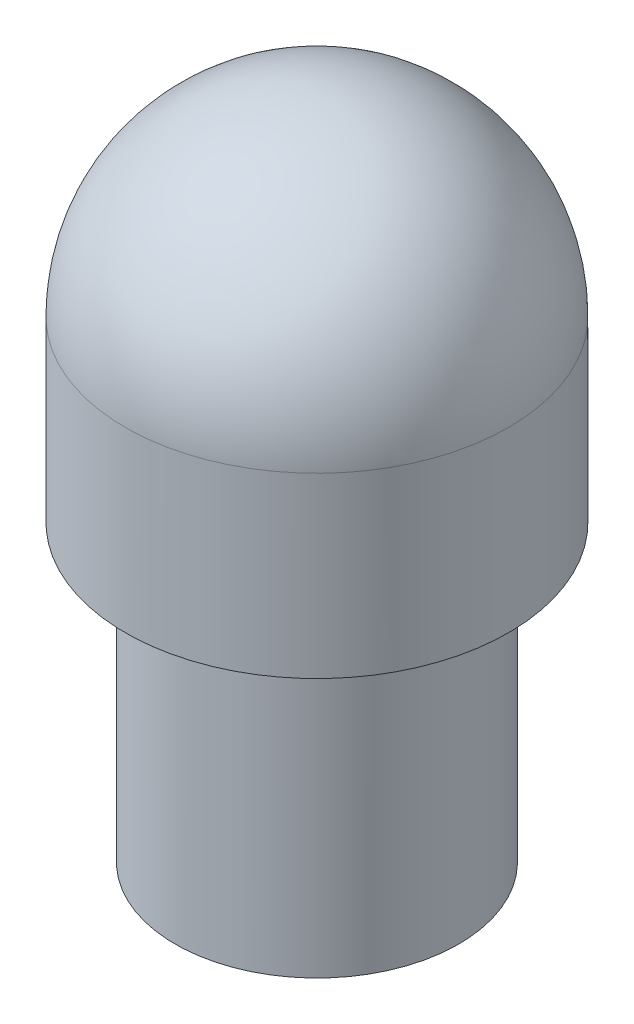
ISO-10303-21;
HEADER;
FILE_DESCRIPTION(('STEP AP214'),'2;1');
FILE_NAME('part.step','',(''),(''),'','','');
FILE_SCHEMA(('AUTOMOTIVE_DESIGN { 1 0 10303 214 1 1 1 1 }'));
ENDSEC;
DATA;
#1=APPLICATION_CONTEXT('core data for automotive mechanical design processes');
#2=APPLICATION_PROTOCOL_DEFINITION('international standard','automotive_design',2000,#1);
#3=PRODUCT_CONTEXT('',#1,'mechanical');
#4=PRODUCT('Part','Part','',(#3));
#5=PRODUCT_RELATED_PRODUCT_CATEGORY('part','',(#4));
#6=PRODUCT_DEFINITION_FORMATION('','',#4);
#7=PRODUCT_DEFINITION_CONTEXT('part definition',#1,'design');
#8=PRODUCT_DEFINITION('design','',#6,#7);
#9=PRODUCT_DEFINITION_SHAPE('','',#8);
#10=(LENGTH_UNIT() NAMED_UNIT(*) SI_UNIT(.MILLI.,.METRE.));
#11=(NAMED_UNIT(*) PLANE_ANGLE_UNIT() SI_UNIT($,.RADIAN.));
#12=(NAMED_UNIT(*) SI_UNIT($,.STERADIAN.) SOLID_ANGLE_UNIT());
#13=UNCERTAINTY_MEASURE_WITH_UNIT(LENGTH_MEASURE(1.E-05),#10,'distance_accuracy_value','');
#14=(GEOMETRIC_REPRESENTATION_CONTEXT(3) GLOBAL_UNCERTAINTY_ASSIGNED_CONTEXT((#13)) GLOBAL_UNIT_ASSIGNED_CONTEXT((#10,
#11,#12)) REPRESENTATION_CONTEXT('',''));
#15=CARTESIAN_POINT('',(0.,0.,0.));
#16=DIRECTION('',(0.,0.,1.));
#17=DIRECTION('',(1.,0.,0.));
#18=AXIS2_PLACEMENT_3D('',#15,#16,#17);
#19=CARTESIAN_POINT('',(0.,38.3921,0.));
#20=DIRECTION('',(0.,-1.,0.));
#21=DIRECTION('',(1.,0.,0.));
#22=AXIS2_PLACEMENT_3D('',#19,#20,#21);
#23=SPHERICAL_SURFACE('',#22,5.2705);
#24=CARTESIAN_POINT('',(0.,38.3921,0.));
#25=DIRECTION('',(0.,-1.,0.));
#26=DIRECTION('',(0.,0.,-1.));
#27=AXIS2_PLACEMENT_3D('',#24,#25,#26);
#28=CIRCLE('',#27,5.2705);
#29=CARTESIAN_POINT('',(0.,38.3921,-5.2705));
#30=VERTEX_POINT('',#29);
#31=EDGE_CURVE('E74',#30,#30,#28,.T.);
#32=ORIENTED_EDGE('',*,*,#31,.F.);
#33=EDGE_LOOP('',(#32));
#34=FACE_BOUND('',#33,.T.);
#35=ADVANCED_FACE('F39',(#34),#23,.T.);
#36=CARTESIAN_POINT('',(0.,25.4,0.));
#37=DIRECTION('',(0.,-1.,0.));
#38=DIRECTION('',(0.,0.,-1.));
#39=AXIS2_PLACEMENT_3D('',#36,#37,#38);
#40=CYLINDRICAL_SURFACE('',#39,5.2705);
#41=CARTESIAN_POINT('',(0.,33.5026,0.));
#42=DIRECTION('',(0.,-1.,0.));
#43=DIRECTION('',(0.,0.,-1.));
#44=AXIS2_PLACEMENT_3D('',#41,#42,#43);
#45=CIRCLE('',#44,5.2705);
#46=CARTESIAN_POINT('',(0.,33.5026,-5.2705));
#47=VERTEX_POINT('',#46);
#48=EDGE_CURVE('E63',#47,#47,#45,.T.);
#49=ORIENTED_EDGE('',*,*,#48,.F.);
#50=EDGE_LOOP('',(#49));
#51=FACE_BOUND('',#50,.T.);
#52=ORIENTED_EDGE('',*,*,#31,.T.);
#53=EDGE_LOOP('',(#52));
#54=FACE_BOUND('',#53,.T.);
#55=ADVANCED_FACE('F90',(#51,#54),#40,.T.);
#56=CARTESIAN_POINT('',(-5.2705,33.5026,0.));
#57=DIRECTION('',(0.,1.,0.));
#58=DIRECTION('',(0.,0.,1.));
#59=AXIS2_PLACEMENT_3D('',#56,#57,#58);
#60=PLANE('',#59);
#61=CARTESIAN_POINT('',(0.,33.5026,0.));
#62=DIRECTION('',(0.,1.,0.));
#63=DIRECTION('',(0.,0.,1.));
#64=AXIS2_PLACEMENT_3D('',#61,#62,#63);
#65=CIRCLE('',#64,4.661);
#66=CARTESIAN_POINT('',(0.,33.5026,4.661));
#67=VERTEX_POINT('',#66);
#68=EDGE_CURVE('E11',#67,#67,#65,.T.);
#69=ORIENTED_EDGE('',*,*,#68,.T.);
#70=EDGE_LOOP('',(#69));
#71=FACE_BOUND('',#70,.T.);
#72=ORIENTED_EDGE('',*,*,#48,.T.);
#73=EDGE_LOOP('',(#72));
#74=FACE_BOUND('',#73,.T.);
#75=ADVANCED_FACE('F95',(#71,#74),#60,.F.);
#76=CARTESIAN_POINT('',(0.,25.4,0.));
#77=DIRECTION('',(0.,-1.,0.));
#78=DIRECTION('',(0.,0.,-1.));
#79=AXIS2_PLACEMENT_3D('',#76,#77,#78);
#80=CYLINDRICAL_SURFACE('',#79,3.899);
#81=CARTESIAN_POINT('',(0.,32.7406,0.));
#82=DIRECTION('',(0.,1.,0.));
#83=DIRECTION('',(0.,0.,1.));
#84=AXIS2_PLACEMENT_3D('',#81,#82,#83);
#85=CIRCLE('',#84,3.899);
#86=CARTESIAN_POINT('',(0.,32.7406,3.899));
#87=VERTEX_POINT('',#86);
#88=EDGE_CURVE('E46',#87,#87,#85,.F.);
#89=ORIENTED_EDGE('',*,*,#88,.T.);
#90=EDGE_LOOP('',(#89));
#91=FACE_BOUND('',#90,.T.);
#92=CARTESIAN_POINT('',(0.,25.4,0.));
#93=DIRECTION('',(0.,-1.,0.));
#94=DIRECTION('',(0.,0.,-1.));
#95=AXIS2_PLACEMENT_3D('',#92,#93,#94);
#96=CIRCLE('',#95,3.899);
#97=CARTESIAN_POINT('',(0.,25.4,-3.899));
#98=VERTEX_POINT('',#97);
#99=EDGE_CURVE('E59',#98,#98,#96,.T.);
#100=ORIENTED_EDGE('',*,*,#99,.F.);
#101=EDGE_LOOP('',(#100));
#102=FACE_BOUND('',#101,.T.);
#103=ADVANCED_FACE('F79',(#91,#102),#80,.T.);
#104=CARTESIAN_POINT('',(-3.899,25.4,0.));
#105=DIRECTION('',(0.,1.,0.));
#106=DIRECTION('',(0.,0.,1.));
#107=AXIS2_PLACEMENT_3D('',#104,#105,#106);
#108=PLANE('',#107);
#109=CARTESIAN_POINT('',(0.,25.4,0.));
#110=DIRECTION('',(0.,-1.,0.));
#111=DIRECTION('',(0.,0.,-1.));
#112=AXIS2_PLACEMENT_3D('',#109,#110,#111);
#113=CIRCLE('',#112,3.5);
#114=CARTESIAN_POINT('',(0.,25.4,-3.5));
#115=VERTEX_POINT('',#114);
#116=EDGE_CURVE('E69',#115,#115,#113,.T.);
#117=ORIENTED_EDGE('',*,*,#116,.F.);
#118=EDGE_LOOP('',(#117));
#119=FACE_BOUND('',#118,.T.);
#120=ORIENTED_EDGE('',*,*,#99,.T.);
#121=EDGE_LOOP('',(#120));
#122=FACE_BOUND('',#121,.T.);
#123=ADVANCED_FACE('F105',(#119,#122),#108,.F.);
#124=CARTESIAN_POINT('',(0.,27.9,0.));
#125=DIRECTION('',(0.,-1.,0.));
#126=DIRECTION('',(0.,0.,-1.));
#127=AXIS2_PLACEMENT_3D('',#124,#125,#126);
#128=PLANE('',#127);
#129=CARTESIAN_POINT('',(0.,27.9,0.));
#130=DIRECTION('',(0.,-1.,0.));
#131=DIRECTION('',(0.,0.,-1.));
#132=AXIS2_PLACEMENT_3D('',#129,#130,#131);
#133=CIRCLE('',#132,3.5);
#134=CARTESIAN_POINT('',(0.,27.9,-3.5));
#135=VERTEX_POINT('',#134);
#136=EDGE_CURVE('E66',#135,#135,#133,.T.);
#137=ORIENTED_EDGE('',*,*,#136,.T.);
#138=EDGE_LOOP('',(#137));
#139=FACE_BOUND('',#138,.T.);
#140=CARTESIAN_POINT('',(0.,27.9,0.));
#141=DIRECTION('',(0.,-1.,0.));
#142=DIRECTION('',(0.,0.,-1.));
#143=AXIS2_PLACEMENT_3D('',#140,#141,#142);
#144=CIRCLE('',#143,2.99999999999999);
#145=CARTESIAN_POINT('',(0.,27.9,-2.99999999999999));
#146=VERTEX_POINT('',#145);
#147=EDGE_CURVE('E60',#146,#146,#144,.F.);
#148=ORIENTED_EDGE('',*,*,#147,.T.);
#149=EDGE_LOOP('',(#148));
#150=FACE_BOUND('',#149,.T.);
#151=ADVANCED_FACE('F107',(#139,#150),#128,.T.);
#152=CARTESIAN_POINT('',(0.,27.9,0.));
#153=DIRECTION('',(0.,-1.,0.));
#154=DIRECTION('',(0.,0.,-1.));
#155=AXIS2_PLACEMENT_3D('',#152,#153,#154);
#156=CYLINDRICAL_SURFACE('',#155,3.5);
#157=ORIENTED_EDGE('',*,*,#136,.F.);
#158=EDGE_LOOP('',(#157));
#159=FACE_BOUND('',#158,.T.);
#160=ORIENTED_EDGE('',*,*,#116,.T.);
#161=EDGE_LOOP('',(#160));
#162=FACE_BOUND('',#161,.T.);
#163=ADVANCED_FACE('F53',(#159,#162),#156,.F.);
#164=CARTESIAN_POINT('',(0.,41.402,0.));
#165=DIRECTION('',(0.,-1.,0.));
#166=DIRECTION('',(0.,0.,-1.));
#167=AXIS2_PLACEMENT_3D('',#164,#165,#166);
#168=CONICAL_SURFACE('',#167,3.,1.02974425867665);
#169=CARTESIAN_POINT('',(0.,43.2045818570827,0.));
#170=VERTEX_POINT('',#169);
#171=VERTEX_LOOP('',#170);
#172=FACE_BOUND('',#171,.T.);
#173=CARTESIAN_POINT('',(0.,41.402,0.));
#174=DIRECTION('',(0.,-1.,0.));
#175=DIRECTION('',(0.,0.,-1.));
#176=AXIS2_PLACEMENT_3D('',#173,#174,#175);
#177=CIRCLE('',#176,3.);
#178=CARTESIAN_POINT('',(0.,41.402,-3.));
#179=VERTEX_POINT('',#178);
#180=EDGE_CURVE('E57',#179,#179,#177,.T.);
#181=ORIENTED_EDGE('',*,*,#180,.T.);
#182=EDGE_LOOP('',(#181));
#183=FACE_BOUND('',#182,.T.);
#184=ADVANCED_FACE('F49',(#172,#183),#168,.F.);
#185=CARTESIAN_POINT('',(0.,25.4,0.));
#186=DIRECTION('',(0.,-1.,0.));
#187=DIRECTION('',(0.,0.,-1.));
#188=AXIS2_PLACEMENT_3D('',#185,#186,#187);
#189=CYLINDRICAL_SURFACE('',#188,2.99999999999999);
#190=ORIENTED_EDGE('',*,*,#180,.F.);
#191=EDGE_LOOP('',(#190));
#192=FACE_BOUND('',#191,.T.);
#193=ORIENTED_EDGE('',*,*,#147,.F.);
#194=EDGE_LOOP('',(#193));
#195=FACE_BOUND('',#194,.T.);
#196=ADVANCED_FACE('F52',(#192,#195),#189,.F.);
#197=CARTESIAN_POINT('',(0.,32.7406,0.));
#198=DIRECTION('',(0.,1.,0.));
#199=DIRECTION('',(0.,0.,1.));
#200=AXIS2_PLACEMENT_3D('',#197,#198,#199);
#201=TOROIDAL_SURFACE('',#200,4.661,0.762);
#202=ORIENTED_EDGE('',*,*,#68,.F.);
#203=EDGE_LOOP('',(#202));
#204=FACE_BOUND('',#203,.T.);
#205=ORIENTED_EDGE('',*,*,#88,.F.);
#206=EDGE_LOOP('',(#205));
#207=FACE_BOUND('',#206,.T.);
#208=ADVANCED_FACE('F41',(#204,#207),#201,.F.);
#209=CLOSED_SHELL('',(#35,#55,#75,#103,#123,#151,#163,#184,#196,#208));
#210=MANIFOLD_SOLID_BREP('B2',#209);
#211=ADVANCED_BREP_SHAPE_REPRESENTATION('',(#18,#210),#14);
#212=SHAPE_DEFINITION_REPRESENTATION(#9,#211);
ENDSEC;
END-ISO-10303-21;
